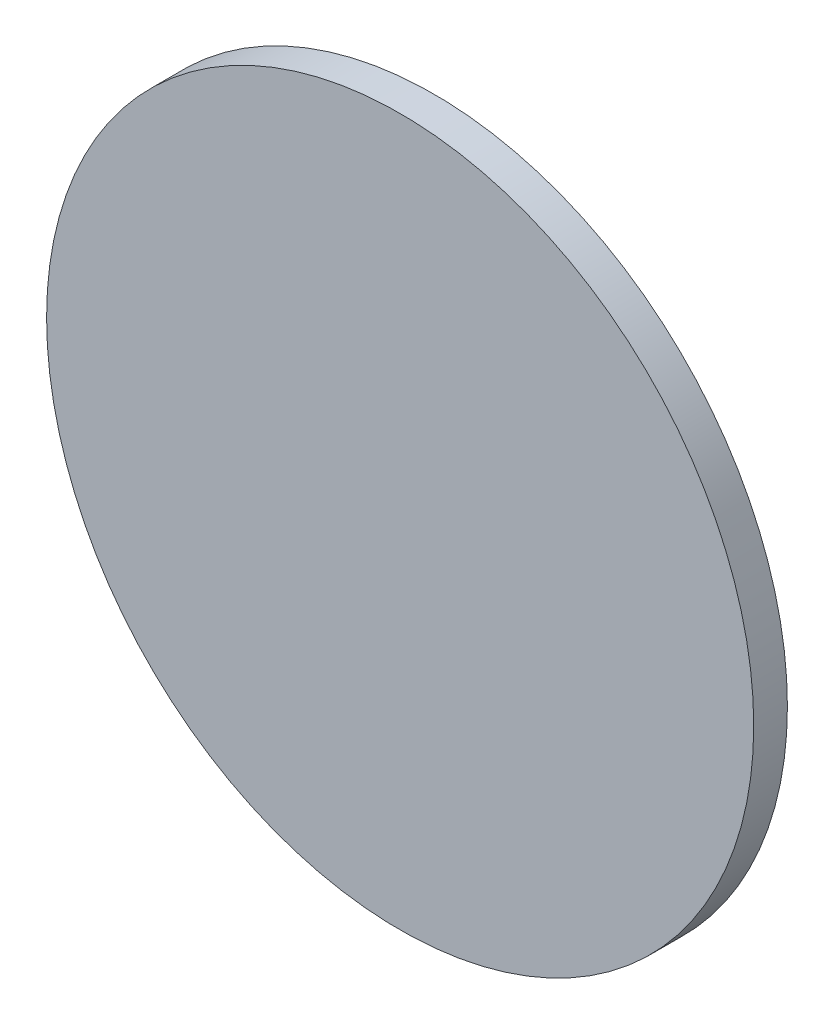
ISO-10303-21;
HEADER;
FILE_DESCRIPTION(('STEP AP214'),'2;1');
FILE_NAME('part.step','',(''),(''),'','','');
FILE_SCHEMA(('AUTOMOTIVE_DESIGN { 1 0 10303 214 1 1 1 1 }'));
ENDSEC;
DATA;
#1=APPLICATION_CONTEXT('core data for automotive mechanical design processes');
#2=APPLICATION_PROTOCOL_DEFINITION('international standard','automotive_design',2000,#1);
#3=PRODUCT_CONTEXT('',#1,'mechanical');
#4=PRODUCT('Part','Part','',(#3));
#5=PRODUCT_RELATED_PRODUCT_CATEGORY('part','',(#4));
#6=PRODUCT_DEFINITION_FORMATION('','',#4);
#7=PRODUCT_DEFINITION_CONTEXT('part definition',#1,'design');
#8=PRODUCT_DEFINITION('design','',#6,#7);
#9=PRODUCT_DEFINITION_SHAPE('','',#8);
#10=(LENGTH_UNIT() NAMED_UNIT(*) SI_UNIT(.MILLI.,.METRE.));
#11=(NAMED_UNIT(*) PLANE_ANGLE_UNIT() SI_UNIT($,.RADIAN.));
#12=(NAMED_UNIT(*) SI_UNIT($,.STERADIAN.) SOLID_ANGLE_UNIT());
#13=UNCERTAINTY_MEASURE_WITH_UNIT(LENGTH_MEASURE(1.E-05),#10,'distance_accuracy_value','');
#14=(GEOMETRIC_REPRESENTATION_CONTEXT(3) GLOBAL_UNCERTAINTY_ASSIGNED_CONTEXT((#13)) GLOBAL_UNIT_ASSIGNED_CONTEXT((#10,
#11,#12)) REPRESENTATION_CONTEXT('',''));
#15=CARTESIAN_POINT('',(0.,0.,0.));
#16=DIRECTION('',(0.,0.,1.));
#17=DIRECTION('',(1.,0.,0.));
#18=AXIS2_PLACEMENT_3D('',#15,#16,#17);
#19=CARTESIAN_POINT('',(0.,0.,4.));
#20=DIRECTION('',(0.,0.,-1.));
#21=DIRECTION('',(-1.,0.,0.));
#22=AXIS2_PLACEMENT_3D('',#19,#20,#21);
#23=CYLINDRICAL_SURFACE('',#22,42.);
#24=CARTESIAN_POINT('',(0.,0.,4.));
#25=DIRECTION('',(0.,0.,1.));
#26=DIRECTION('',(1.,0.,0.));
#27=AXIS2_PLACEMENT_3D('',#24,#25,#26);
#28=CIRCLE('',#27,42.);
#29=CARTESIAN_POINT('',(42.,0.,4.));
#30=VERTEX_POINT('',#29);
#31=EDGE_CURVE('E10',#30,#30,#28,.T.);
#32=ORIENTED_EDGE('',*,*,#31,.F.);
#33=EDGE_LOOP('',(#32));
#34=FACE_BOUND('',#33,.T.);
#35=CARTESIAN_POINT('',(0.,0.,0.));
#36=DIRECTION('',(0.,0.,1.));
#37=DIRECTION('',(1.,0.,0.));
#38=AXIS2_PLACEMENT_3D('',#35,#36,#37);
#39=CIRCLE('',#38,42.);
#40=CARTESIAN_POINT('',(42.,0.,0.));
#41=VERTEX_POINT('',#40);
#42=EDGE_CURVE('E34',#41,#41,#39,.T.);
#43=ORIENTED_EDGE('',*,*,#42,.T.);
#44=EDGE_LOOP('',(#43));
#45=FACE_BOUND('',#44,.T.);
#46=ADVANCED_FACE('F31',(#34,#45),#23,.T.);
#47=CARTESIAN_POINT('',(0.,0.,4.));
#48=DIRECTION('',(0.,0.,1.));
#49=DIRECTION('',(1.,0.,0.));
#50=AXIS2_PLACEMENT_3D('',#47,#48,#49);
#51=PLANE('',#50);
#52=ORIENTED_EDGE('',*,*,#31,.T.);
#53=EDGE_LOOP('',(#52));
#54=FACE_BOUND('',#53,.T.);
#55=ADVANCED_FACE('F46',(#54),#51,.T.);
#56=CARTESIAN_POINT('',(0.,0.,0.));
#57=DIRECTION('',(0.,0.,1.));
#58=DIRECTION('',(1.,0.,0.));
#59=AXIS2_PLACEMENT_3D('',#56,#57,#58);
#60=PLANE('',#59);
#61=ORIENTED_EDGE('',*,*,#42,.F.);
#62=EDGE_LOOP('',(#61));
#63=FACE_BOUND('',#62,.T.);
#64=ADVANCED_FACE('F44',(#63),#60,.F.);
#65=CLOSED_SHELL('',(#46,#55,#64));
#66=MANIFOLD_SOLID_BREP('B2',#65);
#67=ADVANCED_BREP_SHAPE_REPRESENTATION('',(#18,#66),#14);
#68=SHAPE_DEFINITION_REPRESENTATION(#9,#67);
ENDSEC;
END-ISO-10303-21;
